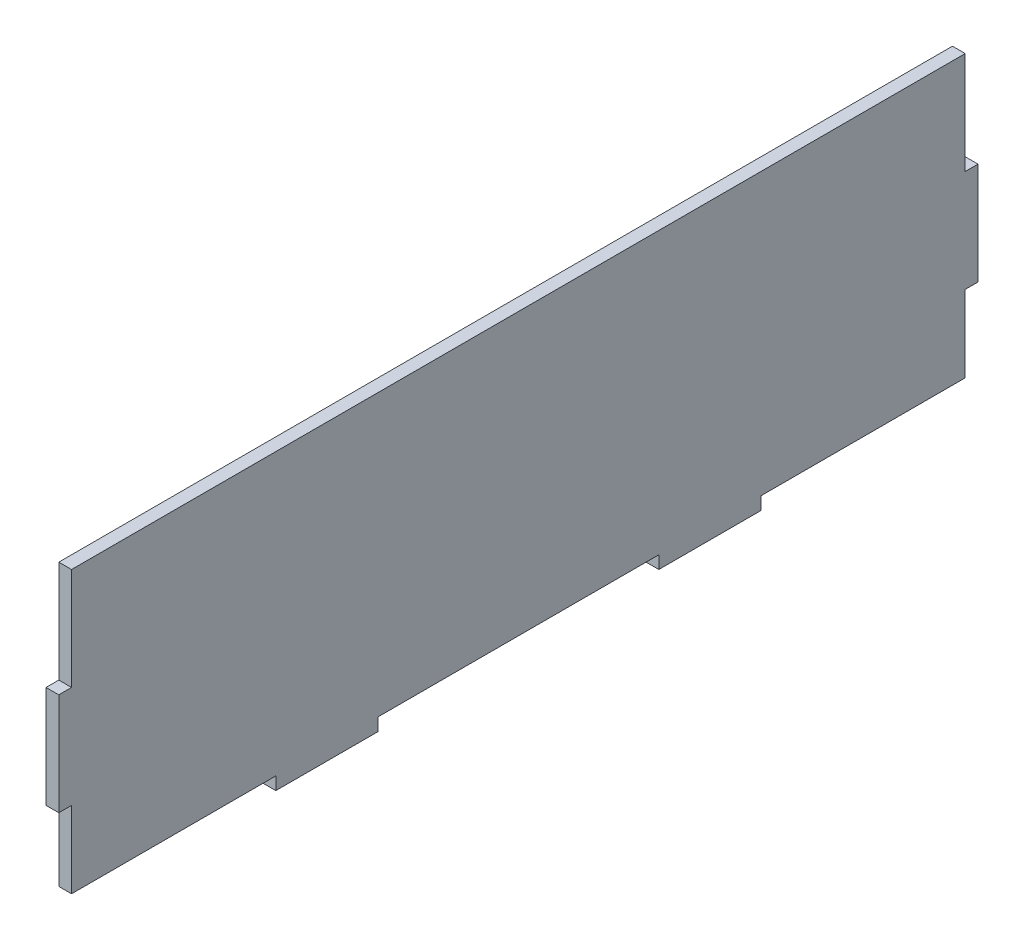
ISO-10303-21;
HEADER;
FILE_DESCRIPTION(('STEP AP214'),'2;1');
FILE_NAME('part.step','',(''),(''),'','','');
FILE_SCHEMA(('AUTOMOTIVE_DESIGN { 1 0 10303 214 1 1 1 1 }'));
ENDSEC;
DATA;
#1=APPLICATION_CONTEXT('core data for automotive mechanical design processes');
#2=APPLICATION_PROTOCOL_DEFINITION('international standard','automotive_design',2000,#1);
#3=PRODUCT_CONTEXT('',#1,'mechanical');
#4=PRODUCT('Part','Part','',(#3));
#5=PRODUCT_RELATED_PRODUCT_CATEGORY('part','',(#4));
#6=PRODUCT_DEFINITION_FORMATION('','',#4);
#7=PRODUCT_DEFINITION_CONTEXT('part definition',#1,'design');
#8=PRODUCT_DEFINITION('design','',#6,#7);
#9=PRODUCT_DEFINITION_SHAPE('','',#8);
#10=(LENGTH_UNIT() NAMED_UNIT(*) SI_UNIT(.MILLI.,.METRE.));
#11=(NAMED_UNIT(*) PLANE_ANGLE_UNIT() SI_UNIT($,.RADIAN.));
#12=(NAMED_UNIT(*) SI_UNIT($,.STERADIAN.) SOLID_ANGLE_UNIT());
#13=UNCERTAINTY_MEASURE_WITH_UNIT(LENGTH_MEASURE(1.E-05),#10,'distance_accuracy_value','');
#14=(GEOMETRIC_REPRESENTATION_CONTEXT(3) GLOBAL_UNCERTAINTY_ASSIGNED_CONTEXT((#13)) GLOBAL_UNIT_ASSIGNED_CONTEXT((#10,
#11,#12)) REPRESENTATION_CONTEXT('',''));
#15=CARTESIAN_POINT('',(0.,0.,0.));
#16=DIRECTION('',(0.,0.,1.));
#17=DIRECTION('',(1.,0.,0.));
#18=AXIS2_PLACEMENT_3D('',#15,#16,#17);
#19=CARTESIAN_POINT('',(3.175,27.0789987206066,116.659983874544));
#20=DIRECTION('',(0.,-1.,0.));
#21=DIRECTION('',(0.,0.,-1.));
#22=AXIS2_PLACEMENT_3D('',#19,#20,#21);
#23=PLANE('',#22);
#24=DIRECTION('',(0.,0.,1.));
#25=VECTOR('',#24,1.);
#26=CARTESIAN_POINT('',(0.,27.0789987206066,116.659983874544));
#27=LINE('',#26,#25);
#28=CARTESIAN_POINT('',(0.,27.0789987206066,-105.590016125456));
#29=VERTEX_POINT('',#28);
#30=CARTESIAN_POINT('',(0.,27.0789987206066,116.659983874544));
#31=VERTEX_POINT('',#30);
#32=EDGE_CURVE('E200',#29,#31,#27,.T.);
#33=ORIENTED_EDGE('',*,*,#32,.T.);
#34=DIRECTION('',(-1.,0.,0.));
#35=VECTOR('',#34,1.);
#36=CARTESIAN_POINT('',(3.175,27.0789987206066,116.659983874544));
#37=LINE('',#36,#35);
#38=CARTESIAN_POINT('',(3.175,27.0789987206066,116.659983874544));
#39=VERTEX_POINT('',#38);
#40=EDGE_CURVE('E11',#39,#31,#37,.T.);
#41=ORIENTED_EDGE('',*,*,#40,.F.);
#42=DIRECTION('',(0.,0.,1.));
#43=VECTOR('',#42,1.);
#44=CARTESIAN_POINT('',(3.175,27.0789987206066,116.659983874544));
#45=LINE('',#44,#43);
#46=CARTESIAN_POINT('',(3.175,27.0789987206066,-105.590016125456));
#47=VERTEX_POINT('',#46);
#48=EDGE_CURVE('E238',#47,#39,#45,.T.);
#49=ORIENTED_EDGE('',*,*,#48,.F.);
#50=DIRECTION('',(-1.,0.,0.));
#51=VECTOR('',#50,1.);
#52=CARTESIAN_POINT('',(3.175,27.0789987206066,-105.590016125456));
#53=LINE('',#52,#51);
#54=EDGE_CURVE('E196',#47,#29,#53,.T.);
#55=ORIENTED_EDGE('',*,*,#54,.T.);
#56=EDGE_LOOP('',(#33,#41,#49,#55));
#57=FACE_BOUND('',#56,.T.);
#58=ADVANCED_FACE('F32',(#57),#23,.F.);
#59=CARTESIAN_POINT('',(3.175,27.0789987206066,116.659983874544));
#60=DIRECTION('',(0.,0.,-1.));
#61=DIRECTION('',(-1.,0.,0.));
#62=AXIS2_PLACEMENT_3D('',#59,#60,#61);
#63=PLANE('',#62);
#64=DIRECTION('',(0.,-1.,0.));
#65=VECTOR('',#64,1.);
#66=CARTESIAN_POINT('',(0.,27.0789987206066,116.659983874544));
#67=LINE('',#66,#65);
#68=CARTESIAN_POINT('',(0.,1.67899872060656,116.659983874544));
#69=VERTEX_POINT('',#68);
#70=EDGE_CURVE('E203',#31,#69,#67,.T.);
#71=ORIENTED_EDGE('',*,*,#70,.T.);
#72=DIRECTION('',(-1.,0.,0.));
#73=VECTOR('',#72,1.);
#74=CARTESIAN_POINT('',(3.175,1.67899872060656,116.659983874544));
#75=LINE('',#74,#73);
#76=CARTESIAN_POINT('',(3.175,1.67899872060656,116.659983874544));
#77=VERTEX_POINT('',#76);
#78=EDGE_CURVE('E40',#77,#69,#75,.T.);
#79=ORIENTED_EDGE('',*,*,#78,.F.);
#80=DIRECTION('',(0.,-1.,0.));
#81=VECTOR('',#80,1.);
#82=CARTESIAN_POINT('',(3.175,27.0789987206066,116.659983874544));
#83=LINE('',#82,#81);
#84=EDGE_CURVE('E127',#39,#77,#83,.T.);
#85=ORIENTED_EDGE('',*,*,#84,.F.);
#86=ORIENTED_EDGE('',*,*,#40,.T.);
#87=EDGE_LOOP('',(#71,#79,#85,#86));
#88=FACE_BOUND('',#87,.T.);
#89=ADVANCED_FACE('F356',(#88),#63,.F.);
#90=CARTESIAN_POINT('',(3.175,1.67899872060656,116.659983874544));
#91=DIRECTION('',(0.,-1.,0.));
#92=DIRECTION('',(0.,0.,-1.));
#93=AXIS2_PLACEMENT_3D('',#90,#91,#92);
#94=PLANE('',#93);
#95=DIRECTION('',(0.,0.,1.));
#96=VECTOR('',#95,1.);
#97=CARTESIAN_POINT('',(0.,1.67899872060656,116.659983874544));
#98=LINE('',#97,#96);
#99=CARTESIAN_POINT('',(0.,1.67899872060656,119.834983874544));
#100=VERTEX_POINT('',#99);
#101=EDGE_CURVE('E205',#69,#100,#98,.T.);
#102=ORIENTED_EDGE('',*,*,#101,.T.);
#103=DIRECTION('',(-1.,0.,0.));
#104=VECTOR('',#103,1.);
#105=CARTESIAN_POINT('',(3.175,1.67899872060656,119.834983874544));
#106=LINE('',#105,#104);
#107=CARTESIAN_POINT('',(3.175,1.67899872060656,119.834983874544));
#108=VERTEX_POINT('',#107);
#109=EDGE_CURVE('E281',#108,#100,#106,.T.);
#110=ORIENTED_EDGE('',*,*,#109,.F.);
#111=DIRECTION('',(0.,0.,1.));
#112=VECTOR('',#111,1.);
#113=CARTESIAN_POINT('',(3.175,1.67899872060656,116.659983874544));
#114=LINE('',#113,#112);
#115=EDGE_CURVE('E289',#77,#108,#114,.T.);
#116=ORIENTED_EDGE('',*,*,#115,.F.);
#117=ORIENTED_EDGE('',*,*,#78,.T.);
#118=EDGE_LOOP('',(#102,#110,#116,#117));
#119=FACE_BOUND('',#118,.T.);
#120=ADVANCED_FACE('F287',(#119),#94,.F.);
#121=CARTESIAN_POINT('',(3.175,1.67899872060656,119.834983874544));
#122=DIRECTION('',(0.,0.,-1.));
#123=DIRECTION('',(0.,1.,0.));
#124=AXIS2_PLACEMENT_3D('',#121,#122,#123);
#125=PLANE('',#124);
#126=DIRECTION('',(0.,-1.,0.));
#127=VECTOR('',#126,1.);
#128=CARTESIAN_POINT('',(0.,1.67899872060656,119.834983874544));
#129=LINE('',#128,#127);
#130=CARTESIAN_POINT('',(0.,-23.7210012793934,119.834983874544));
#131=VERTEX_POINT('',#130);
#132=EDGE_CURVE('E207',#100,#131,#129,.T.);
#133=ORIENTED_EDGE('',*,*,#132,.T.);
#134=DIRECTION('',(-1.,0.,0.));
#135=VECTOR('',#134,1.);
#136=CARTESIAN_POINT('',(3.175,-23.7210012793934,119.834983874544));
#137=LINE('',#136,#135);
#138=CARTESIAN_POINT('',(3.175,-23.7210012793934,119.834983874544));
#139=VERTEX_POINT('',#138);
#140=EDGE_CURVE('E278',#139,#131,#137,.T.);
#141=ORIENTED_EDGE('',*,*,#140,.F.);
#142=DIRECTION('',(0.,-1.,0.));
#143=VECTOR('',#142,1.);
#144=CARTESIAN_POINT('',(3.175,1.67899872060656,119.834983874544));
#145=LINE('',#144,#143);
#146=EDGE_CURVE('E307',#108,#139,#145,.T.);
#147=ORIENTED_EDGE('',*,*,#146,.F.);
#148=ORIENTED_EDGE('',*,*,#109,.T.);
#149=EDGE_LOOP('',(#133,#141,#147,#148));
#150=FACE_BOUND('',#149,.T.);
#151=ADVANCED_FACE('F298',(#150),#125,.F.);
#152=CARTESIAN_POINT('',(3.175,-23.7210012793934,119.834983874544));
#153=DIRECTION('',(0.,1.,0.));
#154=DIRECTION('',(0.,0.,1.));
#155=AXIS2_PLACEMENT_3D('',#152,#153,#154);
#156=PLANE('',#155);
#157=DIRECTION('',(0.,0.,-1.));
#158=VECTOR('',#157,1.);
#159=CARTESIAN_POINT('',(0.,-23.7210012793934,119.834983874544));
#160=LINE('',#159,#158);
#161=CARTESIAN_POINT('',(0.,-23.7210012793934,116.659983874544));
#162=VERTEX_POINT('',#161);
#163=EDGE_CURVE('E209',#131,#162,#160,.T.);
#164=ORIENTED_EDGE('',*,*,#163,.T.);
#165=DIRECTION('',(-1.,0.,0.));
#166=VECTOR('',#165,1.);
#167=CARTESIAN_POINT('',(3.175,-23.7210012793934,116.659983874544));
#168=LINE('',#167,#166);
#169=CARTESIAN_POINT('',(3.175,-23.7210012793934,116.659983874544));
#170=VERTEX_POINT('',#169);
#171=EDGE_CURVE('E275',#170,#162,#168,.T.);
#172=ORIENTED_EDGE('',*,*,#171,.F.);
#173=DIRECTION('',(0.,0.,-1.));
#174=VECTOR('',#173,1.);
#175=CARTESIAN_POINT('',(3.175,-23.7210012793934,119.834983874544));
#176=LINE('',#175,#174);
#177=EDGE_CURVE('E304',#139,#170,#176,.T.);
#178=ORIENTED_EDGE('',*,*,#177,.F.);
#179=ORIENTED_EDGE('',*,*,#140,.T.);
#180=EDGE_LOOP('',(#164,#172,#178,#179));
#181=FACE_BOUND('',#180,.T.);
#182=ADVANCED_FACE('F302',(#181),#156,.F.);
#183=CARTESIAN_POINT('',(3.175,-23.7210012793934,116.659983874544));
#184=DIRECTION('',(0.,0.,-1.));
#185=DIRECTION('',(-1.,0.,0.));
#186=AXIS2_PLACEMENT_3D('',#183,#184,#185);
#187=PLANE('',#186);
#188=DIRECTION('',(0.,-1.,0.));
#189=VECTOR('',#188,1.);
#190=CARTESIAN_POINT('',(0.,-23.7210012793934,116.659983874544));
#191=LINE('',#190,#189);
#192=CARTESIAN_POINT('',(0.,-42.7710012793934,116.659983874544));
#193=VERTEX_POINT('',#192);
#194=EDGE_CURVE('E211',#162,#193,#191,.T.);
#195=ORIENTED_EDGE('',*,*,#194,.T.);
#196=DIRECTION('',(-1.,0.,0.));
#197=VECTOR('',#196,1.);
#198=CARTESIAN_POINT('',(3.175,-42.7710012793934,116.659983874544));
#199=LINE('',#198,#197);
#200=CARTESIAN_POINT('',(3.175,-42.7710012793934,116.659983874544));
#201=VERTEX_POINT('',#200);
#202=EDGE_CURVE('E272',#201,#193,#199,.T.);
#203=ORIENTED_EDGE('',*,*,#202,.F.);
#204=DIRECTION('',(0.,-1.,0.));
#205=VECTOR('',#204,1.);
#206=CARTESIAN_POINT('',(3.175,-23.7210012793934,116.659983874544));
#207=LINE('',#206,#205);
#208=EDGE_CURVE('E306',#170,#201,#207,.T.);
#209=ORIENTED_EDGE('',*,*,#208,.F.);
#210=ORIENTED_EDGE('',*,*,#171,.T.);
#211=EDGE_LOOP('',(#195,#203,#209,#210));
#212=FACE_BOUND('',#211,.T.);
#213=ADVANCED_FACE('F369',(#212),#187,.F.);
#214=CARTESIAN_POINT('',(3.175,-42.7710012793934,116.659983874544));
#215=DIRECTION('',(0.,1.,0.));
#216=DIRECTION('',(0.,0.,1.));
#217=AXIS2_PLACEMENT_3D('',#214,#215,#216);
#218=PLANE('',#217);
#219=DIRECTION('',(0.,0.,-1.));
#220=VECTOR('',#219,1.);
#221=CARTESIAN_POINT('',(0.,-42.7710012793934,116.659983874544));
#222=LINE('',#221,#220);
#223=CARTESIAN_POINT('',(0.,-42.7710012793934,65.8599838745438));
#224=VERTEX_POINT('',#223);
#225=EDGE_CURVE('E213',#193,#224,#222,.T.);
#226=ORIENTED_EDGE('',*,*,#225,.T.);
#227=DIRECTION('',(-1.,0.,0.));
#228=VECTOR('',#227,1.);
#229=CARTESIAN_POINT('',(3.175,-42.7710012793934,65.8599838745438));
#230=LINE('',#229,#228);
#231=CARTESIAN_POINT('',(3.175,-42.7710012793934,65.8599838745438));
#232=VERTEX_POINT('',#231);
#233=EDGE_CURVE('E269',#232,#224,#230,.T.);
#234=ORIENTED_EDGE('',*,*,#233,.F.);
#235=DIRECTION('',(0.,0.,-1.));
#236=VECTOR('',#235,1.);
#237=CARTESIAN_POINT('',(3.175,-42.7710012793934,116.659983874544));
#238=LINE('',#237,#236);
#239=EDGE_CURVE('E309',#201,#232,#238,.T.);
#240=ORIENTED_EDGE('',*,*,#239,.F.);
#241=ORIENTED_EDGE('',*,*,#202,.T.);
#242=EDGE_LOOP('',(#226,#234,#240,#241));
#243=FACE_BOUND('',#242,.T.);
#244=ADVANCED_FACE('F372',(#243),#218,.F.);
#245=CARTESIAN_POINT('',(3.175,-42.7710012793934,65.8599838745438));
#246=DIRECTION('',(0.,0.,-1.));
#247=DIRECTION('',(-1.,0.,0.));
#248=AXIS2_PLACEMENT_3D('',#245,#246,#247);
#249=PLANE('',#248);
#250=DIRECTION('',(0.,-1.,0.));
#251=VECTOR('',#250,1.);
#252=CARTESIAN_POINT('',(0.,-42.7710012793934,65.8599838745438));
#253=LINE('',#252,#251);
#254=CARTESIAN_POINT('',(0.,-45.9460012793934,65.8599838745438));
#255=VERTEX_POINT('',#254);
#256=EDGE_CURVE('E215',#224,#255,#253,.T.);
#257=ORIENTED_EDGE('',*,*,#256,.T.);
#258=DIRECTION('',(-1.,0.,0.));
#259=VECTOR('',#258,1.);
#260=CARTESIAN_POINT('',(3.175,-45.9460012793934,65.8599838745438));
#261=LINE('',#260,#259);
#262=CARTESIAN_POINT('',(3.175,-45.9460012793934,65.8599838745438));
#263=VERTEX_POINT('',#262);
#264=EDGE_CURVE('E266',#263,#255,#261,.T.);
#265=ORIENTED_EDGE('',*,*,#264,.F.);
#266=DIRECTION('',(0.,-1.,0.));
#267=VECTOR('',#266,1.);
#268=CARTESIAN_POINT('',(3.175,-42.7710012793934,65.8599838745438));
#269=LINE('',#268,#267);
#270=EDGE_CURVE('E315',#232,#263,#269,.T.);
#271=ORIENTED_EDGE('',*,*,#270,.F.);
#272=ORIENTED_EDGE('',*,*,#233,.T.);
#273=EDGE_LOOP('',(#257,#265,#271,#272));
#274=FACE_BOUND('',#273,.T.);
#275=ADVANCED_FACE('F376',(#274),#249,.F.);
#276=CARTESIAN_POINT('',(3.175,-45.9460012793934,65.8599838745438));
#277=DIRECTION('',(0.,1.,0.));
#278=DIRECTION('',(0.,0.,1.));
#279=AXIS2_PLACEMENT_3D('',#276,#277,#278);
#280=PLANE('',#279);
#281=DIRECTION('',(0.,0.,-1.));
#282=VECTOR('',#281,1.);
#283=CARTESIAN_POINT('',(0.,-45.9460012793934,65.8599838745438));
#284=LINE('',#283,#282);
#285=CARTESIAN_POINT('',(0.,-45.9460012793934,40.4599838745438));
#286=VERTEX_POINT('',#285);
#287=EDGE_CURVE('E217',#255,#286,#284,.T.);
#288=ORIENTED_EDGE('',*,*,#287,.T.);
#289=DIRECTION('',(-1.,0.,0.));
#290=VECTOR('',#289,1.);
#291=CARTESIAN_POINT('',(3.175,-45.9460012793934,40.4599838745438));
#292=LINE('',#291,#290);
#293=CARTESIAN_POINT('',(3.175,-45.9460012793934,40.4599838745438));
#294=VERTEX_POINT('',#293);
#295=EDGE_CURVE('E263',#294,#286,#292,.T.);
#296=ORIENTED_EDGE('',*,*,#295,.F.);
#297=DIRECTION('',(0.,0.,-1.));
#298=VECTOR('',#297,1.);
#299=CARTESIAN_POINT('',(3.175,-45.9460012793934,65.8599838745438));
#300=LINE('',#299,#298);
#301=EDGE_CURVE('E317',#263,#294,#300,.T.);
#302=ORIENTED_EDGE('',*,*,#301,.F.);
#303=ORIENTED_EDGE('',*,*,#264,.T.);
#304=EDGE_LOOP('',(#288,#296,#302,#303));
#305=FACE_BOUND('',#304,.T.);
#306=ADVANCED_FACE('F380',(#305),#280,.F.);
#307=CARTESIAN_POINT('',(3.175,-45.9460012793934,40.4599838745438));
#308=DIRECTION('',(0.,0.,1.));
#309=DIRECTION('',(0.,-1.,0.));
#310=AXIS2_PLACEMENT_3D('',#307,#308,#309);
#311=PLANE('',#310);
#312=DIRECTION('',(0.,1.,0.));
#313=VECTOR('',#312,1.);
#314=CARTESIAN_POINT('',(0.,-45.9460012793934,40.4599838745438));
#315=LINE('',#314,#313);
#316=CARTESIAN_POINT('',(0.,-42.7710012793934,40.4599838745438));
#317=VERTEX_POINT('',#316);
#318=EDGE_CURVE('E219',#286,#317,#315,.T.);
#319=ORIENTED_EDGE('',*,*,#318,.T.);
#320=DIRECTION('',(-1.,0.,0.));
#321=VECTOR('',#320,1.);
#322=CARTESIAN_POINT('',(3.175,-42.7710012793934,40.4599838745438));
#323=LINE('',#322,#321);
#324=CARTESIAN_POINT('',(3.175,-42.7710012793934,40.4599838745438));
#325=VERTEX_POINT('',#324);
#326=EDGE_CURVE('E260',#325,#317,#323,.T.);
#327=ORIENTED_EDGE('',*,*,#326,.F.);
#328=DIRECTION('',(0.,1.,0.));
#329=VECTOR('',#328,1.);
#330=CARTESIAN_POINT('',(3.175,-45.9460012793934,40.4599838745438));
#331=LINE('',#330,#329);
#332=EDGE_CURVE('E319',#294,#325,#331,.T.);
#333=ORIENTED_EDGE('',*,*,#332,.F.);
#334=ORIENTED_EDGE('',*,*,#295,.T.);
#335=EDGE_LOOP('',(#319,#327,#333,#334));
#336=FACE_BOUND('',#335,.T.);
#337=ADVANCED_FACE('F384',(#336),#311,.F.);
#338=CARTESIAN_POINT('',(3.175,-42.7710012793934,40.4599838745438));
#339=DIRECTION('',(0.,1.,0.));
#340=DIRECTION('',(0.,0.,1.));
#341=AXIS2_PLACEMENT_3D('',#338,#339,#340);
#342=PLANE('',#341);
#343=DIRECTION('',(0.,0.,-1.));
#344=VECTOR('',#343,1.);
#345=CARTESIAN_POINT('',(0.,-42.7710012793934,40.4599838745438));
#346=LINE('',#345,#344);
#347=CARTESIAN_POINT('',(0.,-42.7710012793934,-29.3900161254561));
#348=VERTEX_POINT('',#347);
#349=EDGE_CURVE('E221',#317,#348,#346,.T.);
#350=ORIENTED_EDGE('',*,*,#349,.T.);
#351=DIRECTION('',(-1.,0.,0.));
#352=VECTOR('',#351,1.);
#353=CARTESIAN_POINT('',(3.175,-42.7710012793934,-29.3900161254561));
#354=LINE('',#353,#352);
#355=CARTESIAN_POINT('',(3.175,-42.7710012793934,-29.3900161254561));
#356=VERTEX_POINT('',#355);
#357=EDGE_CURVE('E257',#356,#348,#354,.T.);
#358=ORIENTED_EDGE('',*,*,#357,.F.);
#359=DIRECTION('',(0.,0.,-1.));
#360=VECTOR('',#359,1.);
#361=CARTESIAN_POINT('',(3.175,-42.7710012793934,40.4599838745438));
#362=LINE('',#361,#360);
#363=EDGE_CURVE('E321',#325,#356,#362,.T.);
#364=ORIENTED_EDGE('',*,*,#363,.F.);
#365=ORIENTED_EDGE('',*,*,#326,.T.);
#366=EDGE_LOOP('',(#350,#358,#364,#365));
#367=FACE_BOUND('',#366,.T.);
#368=ADVANCED_FACE('F388',(#367),#342,.F.);
#369=CARTESIAN_POINT('',(3.175,-42.7710012793934,-29.3900161254561));
#370=DIRECTION('',(0.,0.,-1.));
#371=DIRECTION('',(0.,1.,0.));
#372=AXIS2_PLACEMENT_3D('',#369,#370,#371);
#373=PLANE('',#372);
#374=DIRECTION('',(0.,-1.,0.));
#375=VECTOR('',#374,1.);
#376=CARTESIAN_POINT('',(0.,-42.7710012793934,-29.3900161254561));
#377=LINE('',#376,#375);
#378=CARTESIAN_POINT('',(0.,-45.9460012793934,-29.3900161254561));
#379=VERTEX_POINT('',#378);
#380=EDGE_CURVE('E223',#348,#379,#377,.T.);
#381=ORIENTED_EDGE('',*,*,#380,.T.);
#382=DIRECTION('',(-1.,0.,0.));
#383=VECTOR('',#382,1.);
#384=CARTESIAN_POINT('',(3.175,-45.9460012793934,-29.3900161254561));
#385=LINE('',#384,#383);
#386=CARTESIAN_POINT('',(3.175,-45.9460012793934,-29.3900161254561));
#387=VERTEX_POINT('',#386);
#388=EDGE_CURVE('E254',#387,#379,#385,.T.);
#389=ORIENTED_EDGE('',*,*,#388,.F.);
#390=DIRECTION('',(0.,-1.,0.));
#391=VECTOR('',#390,1.);
#392=CARTESIAN_POINT('',(3.175,-42.7710012793934,-29.3900161254561));
#393=LINE('',#392,#391);
#394=EDGE_CURVE('E323',#356,#387,#393,.T.);
#395=ORIENTED_EDGE('',*,*,#394,.F.);
#396=ORIENTED_EDGE('',*,*,#357,.T.);
#397=EDGE_LOOP('',(#381,#389,#395,#396));
#398=FACE_BOUND('',#397,.T.);
#399=ADVANCED_FACE('F392',(#398),#373,.F.);
#400=CARTESIAN_POINT('',(3.175,-45.9460012793934,-29.3900161254561));
#401=DIRECTION('',(0.,1.,0.));
#402=DIRECTION('',(0.,0.,1.));
#403=AXIS2_PLACEMENT_3D('',#400,#401,#402);
#404=PLANE('',#403);
#405=DIRECTION('',(0.,0.,-1.));
#406=VECTOR('',#405,1.);
#407=CARTESIAN_POINT('',(0.,-45.9460012793934,-29.3900161254561));
#408=LINE('',#407,#406);
#409=CARTESIAN_POINT('',(0.,-45.9460012793934,-54.7900161254561));
#410=VERTEX_POINT('',#409);
#411=EDGE_CURVE('E225',#379,#410,#408,.T.);
#412=ORIENTED_EDGE('',*,*,#411,.T.);
#413=DIRECTION('',(-1.,0.,0.));
#414=VECTOR('',#413,1.);
#415=CARTESIAN_POINT('',(3.175,-45.9460012793934,-54.7900161254561));
#416=LINE('',#415,#414);
#417=CARTESIAN_POINT('',(3.175,-45.9460012793934,-54.7900161254561));
#418=VERTEX_POINT('',#417);
#419=EDGE_CURVE('E251',#418,#410,#416,.T.);
#420=ORIENTED_EDGE('',*,*,#419,.F.);
#421=DIRECTION('',(0.,0.,-1.));
#422=VECTOR('',#421,1.);
#423=CARTESIAN_POINT('',(3.175,-45.9460012793934,-29.3900161254561));
#424=LINE('',#423,#422);
#425=EDGE_CURVE('E325',#387,#418,#424,.T.);
#426=ORIENTED_EDGE('',*,*,#425,.F.);
#427=ORIENTED_EDGE('',*,*,#388,.T.);
#428=EDGE_LOOP('',(#412,#420,#426,#427));
#429=FACE_BOUND('',#428,.T.);
#430=ADVANCED_FACE('F396',(#429),#404,.F.);
#431=CARTESIAN_POINT('',(3.175,-45.9460012793934,-54.7900161254561));
#432=DIRECTION('',(0.,0.,1.));
#433=DIRECTION('',(0.,-1.,0.));
#434=AXIS2_PLACEMENT_3D('',#431,#432,#433);
#435=PLANE('',#434);
#436=DIRECTION('',(0.,1.,0.));
#437=VECTOR('',#436,1.);
#438=CARTESIAN_POINT('',(0.,-45.9460012793934,-54.7900161254561));
#439=LINE('',#438,#437);
#440=CARTESIAN_POINT('',(0.,-42.7710012793934,-54.7900161254562));
#441=VERTEX_POINT('',#440);
#442=EDGE_CURVE('E227',#410,#441,#439,.T.);
#443=ORIENTED_EDGE('',*,*,#442,.T.);
#444=DIRECTION('',(-1.,0.,0.));
#445=VECTOR('',#444,1.);
#446=CARTESIAN_POINT('',(3.175,-42.7710012793934,-54.7900161254562));
#447=LINE('',#446,#445);
#448=CARTESIAN_POINT('',(3.175,-42.7710012793934,-54.7900161254562));
#449=VERTEX_POINT('',#448);
#450=EDGE_CURVE('E248',#449,#441,#447,.T.);
#451=ORIENTED_EDGE('',*,*,#450,.F.);
#452=DIRECTION('',(0.,1.,0.));
#453=VECTOR('',#452,1.);
#454=CARTESIAN_POINT('',(3.175,-45.9460012793934,-54.7900161254561));
#455=LINE('',#454,#453);
#456=EDGE_CURVE('E327',#418,#449,#455,.T.);
#457=ORIENTED_EDGE('',*,*,#456,.F.);
#458=ORIENTED_EDGE('',*,*,#419,.T.);
#459=EDGE_LOOP('',(#443,#451,#457,#458));
#460=FACE_BOUND('',#459,.T.);
#461=ADVANCED_FACE('F400',(#460),#435,.F.);
#462=CARTESIAN_POINT('',(3.175,-42.7710012793934,-54.7900161254562));
#463=DIRECTION('',(0.,1.,0.));
#464=DIRECTION('',(0.,0.,1.));
#465=AXIS2_PLACEMENT_3D('',#462,#463,#464);
#466=PLANE('',#465);
#467=DIRECTION('',(0.,0.,-1.));
#468=VECTOR('',#467,1.);
#469=CARTESIAN_POINT('',(0.,-42.7710012793934,-54.7900161254562));
#470=LINE('',#469,#468);
#471=CARTESIAN_POINT('',(0.,-42.7710012793934,-105.590016125456));
#472=VERTEX_POINT('',#471);
#473=EDGE_CURVE('E229',#441,#472,#470,.T.);
#474=ORIENTED_EDGE('',*,*,#473,.T.);
#475=DIRECTION('',(-1.,0.,0.));
#476=VECTOR('',#475,1.);
#477=CARTESIAN_POINT('',(3.175,-42.7710012793934,-105.590016125456));
#478=LINE('',#477,#476);
#479=CARTESIAN_POINT('',(3.175,-42.7710012793934,-105.590016125456));
#480=VERTEX_POINT('',#479);
#481=EDGE_CURVE('E245',#480,#472,#478,.T.);
#482=ORIENTED_EDGE('',*,*,#481,.F.);
#483=DIRECTION('',(0.,0.,-1.));
#484=VECTOR('',#483,1.);
#485=CARTESIAN_POINT('',(3.175,-42.7710012793934,-54.7900161254562));
#486=LINE('',#485,#484);
#487=EDGE_CURVE('E329',#449,#480,#486,.T.);
#488=ORIENTED_EDGE('',*,*,#487,.F.);
#489=ORIENTED_EDGE('',*,*,#450,.T.);
#490=EDGE_LOOP('',(#474,#482,#488,#489));
#491=FACE_BOUND('',#490,.T.);
#492=ADVANCED_FACE('F404',(#491),#466,.F.);
#493=CARTESIAN_POINT('',(3.175,-23.7210012793934,-105.590016125456));
#494=DIRECTION('',(0.,0.,1.));
#495=DIRECTION('',(0.,-1.,0.));
#496=AXIS2_PLACEMENT_3D('',#493,#494,#495);
#497=PLANE('',#496);
#498=DIRECTION('',(0.,1.,0.));
#499=VECTOR('',#498,1.);
#500=CARTESIAN_POINT('',(0.,-23.7210012793934,-105.590016125456));
#501=LINE('',#500,#499);
#502=CARTESIAN_POINT('',(0.,-23.7210012793934,-105.590016125456));
#503=VERTEX_POINT('',#502);
#504=EDGE_CURVE('E231',#472,#503,#501,.T.);
#505=ORIENTED_EDGE('',*,*,#504,.T.);
#506=DIRECTION('',(-1.,0.,0.));
#507=VECTOR('',#506,1.);
#508=CARTESIAN_POINT('',(3.175,-23.7210012793934,-105.590016125456));
#509=LINE('',#508,#507);
#510=CARTESIAN_POINT('',(3.175,-23.7210012793934,-105.590016125456));
#511=VERTEX_POINT('',#510);
#512=EDGE_CURVE('E242',#511,#503,#509,.T.);
#513=ORIENTED_EDGE('',*,*,#512,.F.);
#514=DIRECTION('',(0.,1.,0.));
#515=VECTOR('',#514,1.);
#516=CARTESIAN_POINT('',(3.175,-23.7210012793934,-105.590016125456));
#517=LINE('',#516,#515);
#518=EDGE_CURVE('E331',#480,#511,#517,.T.);
#519=ORIENTED_EDGE('',*,*,#518,.F.);
#520=ORIENTED_EDGE('',*,*,#481,.T.);
#521=EDGE_LOOP('',(#505,#513,#519,#520));
#522=FACE_BOUND('',#521,.T.);
#523=ADVANCED_FACE('F337',(#522),#497,.F.);
#524=CARTESIAN_POINT('',(3.175,-23.7210012793934,-108.765016125456));
#525=DIRECTION('',(0.,1.,0.));
#526=DIRECTION('',(0.,0.,1.));
#527=AXIS2_PLACEMENT_3D('',#524,#525,#526);
#528=PLANE('',#527);
#529=DIRECTION('',(0.,0.,-1.));
#530=VECTOR('',#529,1.);
#531=CARTESIAN_POINT('',(0.,-23.7210012793934,-108.765016125456));
#532=LINE('',#531,#530);
#533=CARTESIAN_POINT('',(0.,-23.7210012793934,-108.765016125456));
#534=VERTEX_POINT('',#533);
#535=EDGE_CURVE('E233',#503,#534,#532,.T.);
#536=ORIENTED_EDGE('',*,*,#535,.T.);
#537=DIRECTION('',(-1.,0.,0.));
#538=VECTOR('',#537,1.);
#539=CARTESIAN_POINT('',(3.175,-23.7210012793934,-108.765016125456));
#540=LINE('',#539,#538);
#541=CARTESIAN_POINT('',(3.175,-23.7210012793934,-108.765016125456));
#542=VERTEX_POINT('',#541);
#543=EDGE_CURVE('E191',#542,#534,#540,.T.);
#544=ORIENTED_EDGE('',*,*,#543,.F.);
#545=DIRECTION('',(0.,0.,-1.));
#546=VECTOR('',#545,1.);
#547=CARTESIAN_POINT('',(3.175,-23.7210012793934,-108.765016125456));
#548=LINE('',#547,#546);
#549=EDGE_CURVE('E182',#511,#542,#548,.T.);
#550=ORIENTED_EDGE('',*,*,#549,.F.);
#551=ORIENTED_EDGE('',*,*,#512,.T.);
#552=EDGE_LOOP('',(#536,#544,#550,#551));
#553=FACE_BOUND('',#552,.T.);
#554=ADVANCED_FACE('F341',(#553),#528,.F.);
#555=CARTESIAN_POINT('',(3.175,1.67899872060658,-108.765016125456));
#556=DIRECTION('',(0.,0.,1.));
#557=DIRECTION('',(0.,-1.,0.));
#558=AXIS2_PLACEMENT_3D('',#555,#556,#557);
#559=PLANE('',#558);
#560=DIRECTION('',(0.,1.,0.));
#561=VECTOR('',#560,1.);
#562=CARTESIAN_POINT('',(0.,1.67899872060658,-108.765016125456));
#563=LINE('',#562,#561);
#564=CARTESIAN_POINT('',(0.,1.67899872060658,-108.765016125456));
#565=VERTEX_POINT('',#564);
#566=EDGE_CURVE('E190',#534,#565,#563,.T.);
#567=ORIENTED_EDGE('',*,*,#566,.T.);
#568=DIRECTION('',(-1.,0.,0.));
#569=VECTOR('',#568,1.);
#570=CARTESIAN_POINT('',(3.175,1.67899872060658,-108.765016125456));
#571=LINE('',#570,#569);
#572=CARTESIAN_POINT('',(3.175,1.67899872060658,-108.765016125456));
#573=VERTEX_POINT('',#572);
#574=EDGE_CURVE('E187',#573,#565,#571,.T.);
#575=ORIENTED_EDGE('',*,*,#574,.F.);
#576=DIRECTION('',(0.,1.,0.));
#577=VECTOR('',#576,1.);
#578=CARTESIAN_POINT('',(3.175,1.67899872060658,-108.765016125456));
#579=LINE('',#578,#577);
#580=EDGE_CURVE('E176',#542,#573,#579,.T.);
#581=ORIENTED_EDGE('',*,*,#580,.F.);
#582=ORIENTED_EDGE('',*,*,#543,.T.);
#583=EDGE_LOOP('',(#567,#575,#581,#582));
#584=FACE_BOUND('',#583,.T.);
#585=ADVANCED_FACE('F188',(#584),#559,.F.);
#586=CARTESIAN_POINT('',(3.175,1.67899872060658,-105.590016125456));
#587=DIRECTION('',(0.,-1.,0.));
#588=DIRECTION('',(0.,0.,-1.));
#589=AXIS2_PLACEMENT_3D('',#586,#587,#588);
#590=PLANE('',#589);
#591=DIRECTION('',(0.,0.,1.));
#592=VECTOR('',#591,1.);
#593=CARTESIAN_POINT('',(0.,1.67899872060658,-105.590016125456));
#594=LINE('',#593,#592);
#595=CARTESIAN_POINT('',(0.,1.67899872060658,-105.590016125456));
#596=VERTEX_POINT('',#595);
#597=EDGE_CURVE('E113',#565,#596,#594,.T.);
#598=ORIENTED_EDGE('',*,*,#597,.T.);
#599=DIRECTION('',(-1.,0.,0.));
#600=VECTOR('',#599,1.);
#601=CARTESIAN_POINT('',(3.175,1.67899872060658,-105.590016125456));
#602=LINE('',#601,#600);
#603=CARTESIAN_POINT('',(3.175,1.67899872060658,-105.590016125456));
#604=VERTEX_POINT('',#603);
#605=EDGE_CURVE('E192',#604,#596,#602,.T.);
#606=ORIENTED_EDGE('',*,*,#605,.F.);
#607=DIRECTION('',(0.,0.,1.));
#608=VECTOR('',#607,1.);
#609=CARTESIAN_POINT('',(3.175,1.67899872060658,-105.590016125456));
#610=LINE('',#609,#608);
#611=EDGE_CURVE('E180',#573,#604,#610,.T.);
#612=ORIENTED_EDGE('',*,*,#611,.F.);
#613=ORIENTED_EDGE('',*,*,#574,.T.);
#614=EDGE_LOOP('',(#598,#606,#612,#613));
#615=FACE_BOUND('',#614,.T.);
#616=ADVANCED_FACE('F194',(#615),#590,.F.);
#617=CARTESIAN_POINT('',(3.175,27.0789987206066,-105.590016125456));
#618=DIRECTION('',(0.,0.,1.));
#619=DIRECTION('',(0.,-1.,0.));
#620=AXIS2_PLACEMENT_3D('',#617,#618,#619);
#621=PLANE('',#620);
#622=DIRECTION('',(0.,1.,0.));
#623=VECTOR('',#622,1.);
#624=CARTESIAN_POINT('',(0.,27.0789987206066,-105.590016125456));
#625=LINE('',#624,#623);
#626=EDGE_CURVE('E119',#596,#29,#625,.T.);
#627=ORIENTED_EDGE('',*,*,#626,.T.);
#628=ORIENTED_EDGE('',*,*,#54,.F.);
#629=DIRECTION('',(0.,1.,0.));
#630=VECTOR('',#629,1.);
#631=CARTESIAN_POINT('',(3.175,27.0789987206066,-105.590016125456));
#632=LINE('',#631,#630);
#633=EDGE_CURVE('E48',#604,#47,#632,.T.);
#634=ORIENTED_EDGE('',*,*,#633,.F.);
#635=ORIENTED_EDGE('',*,*,#605,.T.);
#636=EDGE_LOOP('',(#627,#628,#634,#635));
#637=FACE_BOUND('',#636,.T.);
#638=ADVANCED_FACE('F345',(#637),#621,.F.);
#639=CARTESIAN_POINT('',(3.175,0.,0.));
#640=DIRECTION('',(-1.,0.,0.));
#641=DIRECTION('',(0.,0.,1.));
#642=AXIS2_PLACEMENT_3D('',#639,#640,#641);
#643=PLANE('',#642);
#644=ORIENTED_EDGE('',*,*,#48,.T.);
#645=ORIENTED_EDGE('',*,*,#84,.T.);
#646=ORIENTED_EDGE('',*,*,#115,.T.);
#647=ORIENTED_EDGE('',*,*,#146,.T.);
#648=ORIENTED_EDGE('',*,*,#177,.T.);
#649=ORIENTED_EDGE('',*,*,#208,.T.);
#650=ORIENTED_EDGE('',*,*,#239,.T.);
#651=ORIENTED_EDGE('',*,*,#270,.T.);
#652=ORIENTED_EDGE('',*,*,#301,.T.);
#653=ORIENTED_EDGE('',*,*,#332,.T.);
#654=ORIENTED_EDGE('',*,*,#363,.T.);
#655=ORIENTED_EDGE('',*,*,#394,.T.);
#656=ORIENTED_EDGE('',*,*,#425,.T.);
#657=ORIENTED_EDGE('',*,*,#456,.T.);
#658=ORIENTED_EDGE('',*,*,#487,.T.);
#659=ORIENTED_EDGE('',*,*,#518,.T.);
#660=ORIENTED_EDGE('',*,*,#549,.T.);
#661=ORIENTED_EDGE('',*,*,#580,.T.);
#662=ORIENTED_EDGE('',*,*,#611,.T.);
#663=ORIENTED_EDGE('',*,*,#633,.T.);
#664=EDGE_LOOP('',(#644,#645,#646,#647,#648,#649,#650,#651,#652,#653,#654,#655,#656,#657,#658,
#659,#660,#661,#662,#663));
#665=FACE_BOUND('',#664,.T.);
#666=ADVANCED_FACE('F178',(#665),#643,.F.);
#667=CARTESIAN_POINT('',(0.,0.,0.));
#668=DIRECTION('',(-1.,0.,0.));
#669=DIRECTION('',(0.,0.,1.));
#670=AXIS2_PLACEMENT_3D('',#667,#668,#669);
#671=PLANE('',#670);
#672=ORIENTED_EDGE('',*,*,#32,.F.);
#673=ORIENTED_EDGE('',*,*,#626,.F.);
#674=ORIENTED_EDGE('',*,*,#597,.F.);
#675=ORIENTED_EDGE('',*,*,#566,.F.);
#676=ORIENTED_EDGE('',*,*,#535,.F.);
#677=ORIENTED_EDGE('',*,*,#504,.F.);
#678=ORIENTED_EDGE('',*,*,#473,.F.);
#679=ORIENTED_EDGE('',*,*,#442,.F.);
#680=ORIENTED_EDGE('',*,*,#411,.F.);
#681=ORIENTED_EDGE('',*,*,#380,.F.);
#682=ORIENTED_EDGE('',*,*,#349,.F.);
#683=ORIENTED_EDGE('',*,*,#318,.F.);
#684=ORIENTED_EDGE('',*,*,#287,.F.);
#685=ORIENTED_EDGE('',*,*,#256,.F.);
#686=ORIENTED_EDGE('',*,*,#225,.F.);
#687=ORIENTED_EDGE('',*,*,#194,.F.);
#688=ORIENTED_EDGE('',*,*,#163,.F.);
#689=ORIENTED_EDGE('',*,*,#132,.F.);
#690=ORIENTED_EDGE('',*,*,#101,.F.);
#691=ORIENTED_EDGE('',*,*,#70,.F.);
#692=EDGE_LOOP('',(#672,#673,#674,#675,#676,#677,#678,#679,#680,#681,#682,#683,#684,#685,#686,
#687,#688,#689,#690,#691));
#693=FACE_BOUND('',#692,.T.);
#694=ADVANCED_FACE('F293',(#693),#671,.T.);
#695=CLOSED_SHELL('',(#58,#89,#120,#151,#182,#213,#244,#275,#306,#337,#368,#399,#430,#461,#492,
#523,#554,#585,#616,#638,#666,#694));
#696=MANIFOLD_SOLID_BREP('B2',#695);
#697=ADVANCED_BREP_SHAPE_REPRESENTATION('',(#18,#696),#14);
#698=SHAPE_DEFINITION_REPRESENTATION(#9,#697);
ENDSEC;
END-ISO-10303-21;
